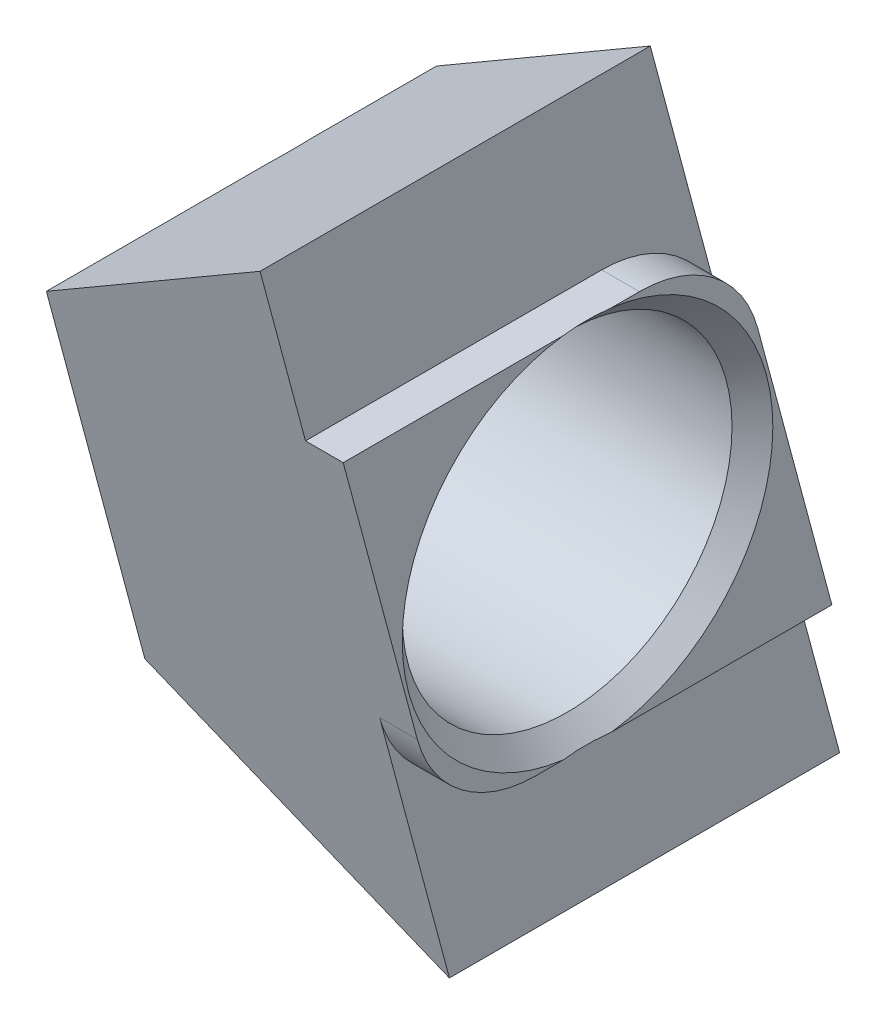
ISO-10303-21;
HEADER;
FILE_DESCRIPTION(('STEP AP214'),'2;1');
FILE_NAME('part.step','',(''),(''),'','','');
FILE_SCHEMA(('AUTOMOTIVE_DESIGN { 1 0 10303 214 1 1 1 1 }'));
ENDSEC;
DATA;
#1=APPLICATION_CONTEXT('core data for automotive mechanical design processes');
#2=APPLICATION_PROTOCOL_DEFINITION('international standard','automotive_design',2000,#1);
#3=PRODUCT_CONTEXT('',#1,'mechanical');
#4=PRODUCT('Part','Part','',(#3));
#5=PRODUCT_RELATED_PRODUCT_CATEGORY('part','',(#4));
#6=PRODUCT_DEFINITION_FORMATION('','',#4);
#7=PRODUCT_DEFINITION_CONTEXT('part definition',#1,'design');
#8=PRODUCT_DEFINITION('design','',#6,#7);
#9=PRODUCT_DEFINITION_SHAPE('','',#8);
#10=(LENGTH_UNIT() NAMED_UNIT(*) SI_UNIT(.MILLI.,.METRE.));
#11=(NAMED_UNIT(*) PLANE_ANGLE_UNIT() SI_UNIT($,.RADIAN.));
#12=(NAMED_UNIT(*) SI_UNIT($,.STERADIAN.) SOLID_ANGLE_UNIT());
#13=UNCERTAINTY_MEASURE_WITH_UNIT(LENGTH_MEASURE(1.E-05),#10,'distance_accuracy_value','');
#14=(GEOMETRIC_REPRESENTATION_CONTEXT(3) GLOBAL_UNCERTAINTY_ASSIGNED_CONTEXT((#13)) GLOBAL_UNIT_ASSIGNED_CONTEXT((#10,
#11,#12)) REPRESENTATION_CONTEXT('',''));
#15=CARTESIAN_POINT('',(0.,0.,0.));
#16=DIRECTION('',(0.,0.,1.));
#17=DIRECTION('',(1.,0.,0.));
#18=AXIS2_PLACEMENT_3D('',#15,#16,#17);
#19=CARTESIAN_POINT('',(-6.3,0.,4.14110472164033));
#20=DIRECTION('',(-1.,0.,0.));
#21=DIRECTION('',(0.,0.,1.));
#22=AXIS2_PLACEMENT_3D('',#19,#20,#21);
#23=PLANE('',#22);
#24=DIRECTION('',(0.,0.,1.));
#25=VECTOR('',#24,1.);
#26=CARTESIAN_POINT('',(-6.3,3.90000000000003,-2.13148577840691));
#27=LINE('',#26,#25);
#28=CARTESIAN_POINT('',(-6.3,3.90000000000003,5.18610657212172));
#29=VERTEX_POINT('',#28);
#30=CARTESIAN_POINT('',(-6.3,3.90000000000003,0.508418135000282));
#31=VERTEX_POINT('',#30);
#32=EDGE_CURVE('E178',#29,#31,#27,.F.);
#33=ORIENTED_EDGE('',*,*,#32,.T.);
#34=CARTESIAN_POINT('',(-6.3,0.,0.));
#35=DIRECTION('',(-1.,0.,0.));
#36=DIRECTION('',(0.,0.,1.));
#37=AXIS2_PLACEMENT_3D('',#34,#35,#36);
#38=CIRCLE('',#37,3.93299999999967);
#39=CARTESIAN_POINT('',(-6.3,-3.90000000000003,0.508418135000279));
#40=VERTEX_POINT('',#39);
#41=EDGE_CURVE('E248',#31,#40,#38,.F.);
#42=ORIENTED_EDGE('',*,*,#41,.T.);
#43=DIRECTION('',(0.,0.,-1.));
#44=VECTOR('',#43,1.);
#45=CARTESIAN_POINT('',(-6.3,-3.90000000000003,2.13148577840691));
#46=LINE('',#45,#44);
#47=CARTESIAN_POINT('',(-6.3,-3.90000000000003,3.09610287115894));
#48=VERTEX_POINT('',#47);
#49=EDGE_CURVE('E200',#40,#48,#46,.F.);
#50=ORIENTED_EDGE('',*,*,#49,.T.);
#51=CARTESIAN_POINT('',(-6.3,-7.5,2.13148577840691));
#52=CARTESIAN_POINT('',(-6.3,-2.5,3.47123174056252));
#53=CARTESIAN_POINT('',(-6.3,2.5,4.81097770271814));
#54=CARTESIAN_POINT('',(-6.3,7.5,6.15072366487375));
#55=B_SPLINE_CURVE_WITH_KNOTS('',3,(#51,#52,#53,#54),.UNSPECIFIED.,.F.,.F.,(4,4),(0.,1.),.UNSPECIFIED.);
#56=EDGE_CURVE('E343',#48,#29,#55,.T.);
#57=ORIENTED_EDGE('',*,*,#56,.T.);
#58=EDGE_LOOP('',(#33,#42,#50,#57));
#59=FACE_BOUND('',#58,.T.);
#60=ADVANCED_FACE('F47',(#59),#23,.T.);
#61=CARTESIAN_POINT('',(0.,1.29999999999999,-1.10105270241365));
#62=DIRECTION('',(1.,0.,0.));
#63=DIRECTION('',(0.,0.,-1.));
#64=AXIS2_PLACEMENT_3D('',#61,#62,#63);
#65=PLANE('',#64);
#66=DIRECTION('',(0.,0.,1.));
#67=VECTOR('',#66,1.);
#68=CARTESIAN_POINT('',(0.,3.9,-1.10105270241365));
#69=LINE('',#68,#67);
#70=CARTESIAN_POINT('',(0.,3.9,-1.10105270241365));
#71=VERTEX_POINT('',#70);
#72=CARTESIAN_POINT('',(0.,3.9,-0.508418135000436));
#73=VERTEX_POINT('',#72);
#74=EDGE_CURVE('E258',#71,#73,#69,.T.);
#75=ORIENTED_EDGE('',*,*,#74,.T.);
#76=CARTESIAN_POINT('',(0.,0.,0.));
#77=DIRECTION('',(1.,0.,0.));
#78=DIRECTION('',(0.,0.,-1.));
#79=AXIS2_PLACEMENT_3D('',#76,#77,#78);
#80=CIRCLE('',#79,3.93299999999966);
#81=CARTESIAN_POINT('',(0.,-3.9,-0.508418135000436));
#82=VERTEX_POINT('',#81);
#83=EDGE_CURVE('E212',#73,#82,#80,.F.);
#84=ORIENTED_EDGE('',*,*,#83,.T.);
#85=DIRECTION('',(0.,0.,-1.));
#86=VECTOR('',#85,1.);
#87=CARTESIAN_POINT('',(0.,-3.9,1.10105270241365));
#88=LINE('',#87,#86);
#89=CARTESIAN_POINT('',(0.,-3.9,-5.18610657212171));
#90=VERTEX_POINT('',#89);
#91=EDGE_CURVE('E276',#82,#90,#88,.T.);
#92=ORIENTED_EDGE('',*,*,#91,.T.);
#93=DIRECTION('',(0.,0.965925826289068,0.25881904510252));
#94=VECTOR('',#93,1.);
#95=CARTESIAN_POINT('',(0.,-3.9,-5.18610657212171));
#96=LINE('',#95,#94);
#97=CARTESIAN_POINT('',(0.,1.97292951726655,-3.61245985076524));
#98=VERTEX_POINT('',#97);
#99=EDGE_CURVE('E282',#90,#98,#96,.T.);
#100=ORIENTED_EDGE('',*,*,#99,.T.);
#101=CARTESIAN_POINT('',(0.,1.29999999999999,-1.10105270241365));
#102=DIRECTION('',(1.,0.,0.));
#103=DIRECTION('',(0.,0.,-1.));
#104=AXIS2_PLACEMENT_3D('',#101,#102,#103);
#105=CIRCLE('',#104,2.60000000000001);
#106=EDGE_CURVE('E180',#98,#71,#105,.T.);
#107=ORIENTED_EDGE('',*,*,#106,.T.);
#108=EDGE_LOOP('',(#75,#84,#92,#100,#107));
#109=FACE_BOUND('',#108,.T.);
#110=ADVANCED_FACE('F262',(#109),#65,.T.);
#111=CARTESIAN_POINT('',(-0.800000000000001,1.29999999999999,-1.10105270241365));
#112=DIRECTION('',(1.,0.,0.));
#113=DIRECTION('',(0.,0.,-1.));
#114=AXIS2_PLACEMENT_3D('',#111,#112,#113);
#115=CYLINDRICAL_SURFACE('',#114,2.60000000000001);
#116=ORIENTED_EDGE('',*,*,#106,.F.);
#117=DIRECTION('',(1.,0.,0.));
#118=VECTOR('',#117,1.);
#119=CARTESIAN_POINT('',(-0.800000000000001,1.97292951726655,-3.61245985076524));
#120=LINE('',#119,#118);
#121=CARTESIAN_POINT('',(-0.800000000000001,1.97292951726655,-3.61245985076523));
#122=VERTEX_POINT('',#121);
#123=EDGE_CURVE('E207',#122,#98,#120,.T.);
#124=ORIENTED_EDGE('',*,*,#123,.F.);
#125=CARTESIAN_POINT('',(-0.800000000000001,1.29999999999999,-1.10105270241365));
#126=DIRECTION('',(1.,0.,0.));
#127=DIRECTION('',(0.,0.,-1.));
#128=AXIS2_PLACEMENT_3D('',#125,#126,#127);
#129=CIRCLE('',#128,2.60000000000001);
#130=CARTESIAN_POINT('',(-0.800000000000001,3.9,-1.10105270241365));
#131=VERTEX_POINT('',#130);
#132=EDGE_CURVE('E284',#122,#131,#129,.T.);
#133=ORIENTED_EDGE('',*,*,#132,.T.);
#134=DIRECTION('',(1.,0.,0.));
#135=VECTOR('',#134,1.);
#136=CARTESIAN_POINT('',(-0.800000000000001,3.9,-1.10105270241365));
#137=LINE('',#136,#135);
#138=EDGE_CURVE('E293',#131,#71,#137,.T.);
#139=ORIENTED_EDGE('',*,*,#138,.T.);
#140=EDGE_LOOP('',(#116,#124,#133,#139));
#141=FACE_BOUND('',#140,.T.);
#142=ADVANCED_FACE('F332',(#141),#115,.T.);
#143=CARTESIAN_POINT('',(-0.800000000000001,-3.9,-5.18610657212171));
#144=DIRECTION('',(0.,0.25881904510252,-0.965925826289068));
#145=DIRECTION('',(0.,0.965925826289068,0.25881904510252));
#146=AXIS2_PLACEMENT_3D('',#143,#144,#145);
#147=PLANE('',#146);
#148=ORIENTED_EDGE('',*,*,#99,.F.);
#149=DIRECTION('',(1.,0.,0.));
#150=VECTOR('',#149,1.);
#151=CARTESIAN_POINT('',(-0.800000000000001,-3.9,-5.18610657212171));
#152=LINE('',#151,#150);
#153=CARTESIAN_POINT('',(-0.800000000000001,-3.9,-5.18610657212171));
#154=VERTEX_POINT('',#153);
#155=EDGE_CURVE('E291',#154,#90,#152,.T.);
#156=ORIENTED_EDGE('',*,*,#155,.F.);
#157=CARTESIAN_POINT('',(-0.800000000000001,7.5,-2.13148577840691));
#158=CARTESIAN_POINT('',(-0.800000000000001,2.5,-3.47123174056252));
#159=CARTESIAN_POINT('',(-0.800000000000001,-2.5,-4.81097770271814));
#160=CARTESIAN_POINT('',(-0.800000000000001,-7.5,-6.15072366487375));
#161=B_SPLINE_CURVE_WITH_KNOTS('',3,(#157,#158,#159,#160),.UNSPECIFIED.,.F.,.F.,(4,4),(0.,1.),.UNSPECIFIED.);
#162=CARTESIAN_POINT('',(-0.800000000000001,-7.5,-6.15072366487375));
#163=VERTEX_POINT('',#162);
#164=EDGE_CURVE('E173',#154,#163,#161,.T.);
#165=ORIENTED_EDGE('',*,*,#164,.T.);
#166=DIRECTION('',(-0.827835666345006,0.541856072516727,0.145189897044757));
#167=VECTOR('',#166,1.);
#168=CARTESIAN_POINT('',(-2.53078460239917,-6.36712280570237,-5.84717013553806));
#169=LINE('',#168,#167);
#170=CARTESIAN_POINT('',(-6.3,-3.90000000000003,-5.18610657212172));
#171=VERTEX_POINT('',#170);
#172=EDGE_CURVE('E186',#171,#163,#169,.F.);
#173=ORIENTED_EDGE('',*,*,#172,.F.);
#174=CARTESIAN_POINT('',(-6.3,7.5,-2.13148577840691));
#175=CARTESIAN_POINT('',(-6.3,2.5,-3.47123174056252));
#176=CARTESIAN_POINT('',(-6.3,-2.5,-4.81097770271814));
#177=CARTESIAN_POINT('',(-6.3,-7.5,-6.15072366487375));
#178=B_SPLINE_CURVE_WITH_KNOTS('',3,(#174,#175,#176,#177),.UNSPECIFIED.,.F.,.F.,(4,4),(0.,1.),.UNSPECIFIED.);
#179=CARTESIAN_POINT('',(-6.3,3.90000000000003,-3.09610287115894));
#180=VERTEX_POINT('',#179);
#181=EDGE_CURVE('E192',#180,#171,#178,.T.);
#182=ORIENTED_EDGE('',*,*,#181,.F.);
#183=DIRECTION('',(-0.827835666345006,-0.541856072516727,-0.145189897044757));
#184=VECTOR('',#183,1.);
#185=CARTESIAN_POINT('',(-0.8,7.5,-2.13148577840691));
#186=LINE('',#185,#184);
#187=CARTESIAN_POINT('',(-0.800000000000001,7.5,-2.13148577840691));
#188=VERTEX_POINT('',#187);
#189=EDGE_CURVE('E181',#180,#188,#186,.F.);
#190=ORIENTED_EDGE('',*,*,#189,.T.);
#191=EDGE_CURVE('E169',#188,#122,#161,.T.);
#192=ORIENTED_EDGE('',*,*,#191,.T.);
#193=ORIENTED_EDGE('',*,*,#123,.T.);
#194=EDGE_LOOP('',(#148,#156,#165,#173,#182,#190,#192,#193));
#195=FACE_BOUND('',#194,.T.);
#196=ADVANCED_FACE('F329',(#195),#147,.T.);
#197=CARTESIAN_POINT('',(-0.800000000000001,-3.9,1.10105270241365));
#198=DIRECTION('',(0.,-1.,0.));
#199=DIRECTION('',(0.,0.,-1.));
#200=AXIS2_PLACEMENT_3D('',#197,#198,#199);
#201=PLANE('',#200);
#202=ORIENTED_EDGE('',*,*,#91,.F.);
#203=CARTESIAN_POINT('',(0.,-3.9,-0.508418135000436));
#204=CARTESIAN_POINT('',(-0.0219999999997728,-3.9,-0.338945423333624));
#205=CARTESIAN_POINT('',(-0.0329999999996592,-3.9,-0.169472711666812));
#206=CARTESIAN_POINT('',(-0.032999999999659,-3.9,0.169472711666811));
#207=CARTESIAN_POINT('',(-0.0219999999997725,-3.9,0.338945423333623));
#208=CARTESIAN_POINT('',(0.,-3.9,0.508418135000435));
#209=B_SPLINE_CURVE_WITH_KNOTS('',3,(#203,#204,#205,#206,#207,#208),.UNSPECIFIED.,.F.,.F.,(4,2,
4),(0.,0.509487978265728,1.01897595653146),.UNSPECIFIED.);
#210=CARTESIAN_POINT('',(0.,-3.9,0.508418135000435));
#211=VERTEX_POINT('',#210);
#212=EDGE_CURVE('E215',#82,#211,#209,.T.);
#213=ORIENTED_EDGE('',*,*,#212,.T.);
#214=CARTESIAN_POINT('',(0.,-3.9,1.10105270241365));
#215=VERTEX_POINT('',#214);
#216=EDGE_CURVE('E273',#215,#211,#88,.T.);
#217=ORIENTED_EDGE('',*,*,#216,.F.);
#218=DIRECTION('',(1.,0.,0.));
#219=VECTOR('',#218,1.);
#220=CARTESIAN_POINT('',(-0.800000000000001,-3.9,1.10105270241365));
#221=LINE('',#220,#219);
#222=CARTESIAN_POINT('',(-0.800000000000001,-3.9,1.10105270241365));
#223=VERTEX_POINT('',#222);
#224=EDGE_CURVE('E289',#223,#215,#221,.T.);
#225=ORIENTED_EDGE('',*,*,#224,.F.);
#226=DIRECTION('',(0.,0.,-1.));
#227=VECTOR('',#226,1.);
#228=CARTESIAN_POINT('',(-0.800000000000001,-3.9,1.10105270241365));
#229=LINE('',#228,#227);
#230=EDGE_CURVE('E295',#223,#154,#229,.T.);
#231=ORIENTED_EDGE('',*,*,#230,.T.);
#232=ORIENTED_EDGE('',*,*,#155,.T.);
#233=EDGE_LOOP('',(#202,#213,#217,#225,#231,#232));
#234=FACE_BOUND('',#233,.T.);
#235=ADVANCED_FACE('F227',(#234),#201,.T.);
#236=CARTESIAN_POINT('',(-0.800000000000001,-1.3,1.10105270241365));
#237=DIRECTION('',(1.,0.,0.));
#238=DIRECTION('',(0.,0.,-1.));
#239=AXIS2_PLACEMENT_3D('',#236,#237,#238);
#240=CYLINDRICAL_SURFACE('',#239,2.6);
#241=CARTESIAN_POINT('',(0.,-1.3,1.10105270241365));
#242=DIRECTION('',(1.,0.,0.));
#243=DIRECTION('',(0.,0.,-1.));
#244=AXIS2_PLACEMENT_3D('',#241,#242,#243);
#245=CIRCLE('',#244,2.6);
#246=CARTESIAN_POINT('',(0.,-1.97292951726655,3.61245985076523));
#247=VERTEX_POINT('',#246);
#248=EDGE_CURVE('E281',#247,#215,#245,.T.);
#249=ORIENTED_EDGE('',*,*,#248,.F.);
#250=DIRECTION('',(1.,0.,0.));
#251=VECTOR('',#250,1.);
#252=CARTESIAN_POINT('',(-0.800000000000001,-1.97292951726655,3.61245985076523));
#253=LINE('',#252,#251);
#254=CARTESIAN_POINT('',(-0.800000000000001,-1.97292951726656,3.61245985076523));
#255=VERTEX_POINT('',#254);
#256=EDGE_CURVE('E292',#255,#247,#253,.T.);
#257=ORIENTED_EDGE('',*,*,#256,.F.);
#258=CARTESIAN_POINT('',(-0.800000000000001,-1.3,1.10105270241365));
#259=DIRECTION('',(1.,0.,0.));
#260=DIRECTION('',(0.,0.,-1.));
#261=AXIS2_PLACEMENT_3D('',#258,#259,#260);
#262=CIRCLE('',#261,2.6);
#263=EDGE_CURVE('E302',#255,#223,#262,.T.);
#264=ORIENTED_EDGE('',*,*,#263,.T.);
#265=ORIENTED_EDGE('',*,*,#224,.T.);
#266=EDGE_LOOP('',(#249,#257,#264,#265));
#267=FACE_BOUND('',#266,.T.);
#268=ADVANCED_FACE('F323',(#267),#240,.T.);
#269=CARTESIAN_POINT('',(-0.800000000000001,3.9,5.18610657212171));
#270=DIRECTION('',(0.,-0.258819045102521,0.965925826289068));
#271=DIRECTION('',(0.,-0.965925826289068,-0.258819045102521));
#272=AXIS2_PLACEMENT_3D('',#269,#270,#271);
#273=PLANE('',#272);
#274=DIRECTION('',(0.,-0.965925826289068,-0.258819045102521));
#275=VECTOR('',#274,1.);
#276=CARTESIAN_POINT('',(0.,3.9,5.18610657212171));
#277=LINE('',#276,#275);
#278=CARTESIAN_POINT('',(0.,3.9,5.18610657212171));
#279=VERTEX_POINT('',#278);
#280=EDGE_CURVE('E266',#279,#247,#277,.T.);
#281=ORIENTED_EDGE('',*,*,#280,.F.);
#282=DIRECTION('',(1.,0.,0.));
#283=VECTOR('',#282,1.);
#284=CARTESIAN_POINT('',(-0.800000000000001,3.9,5.18610657212171));
#285=LINE('',#284,#283);
#286=CARTESIAN_POINT('',(-0.800000000000001,3.9,5.18610657212171));
#287=VERTEX_POINT('',#286);
#288=EDGE_CURVE('E160',#287,#279,#285,.T.);
#289=ORIENTED_EDGE('',*,*,#288,.F.);
#290=CARTESIAN_POINT('',(-0.800000000000001,-7.5,2.13148577840691));
#291=CARTESIAN_POINT('',(-0.800000000000001,-2.5,3.47123174056252));
#292=CARTESIAN_POINT('',(-0.800000000000001,2.5,4.81097770271814));
#293=CARTESIAN_POINT('',(-0.800000000000001,7.5,6.15072366487375));
#294=B_SPLINE_CURVE_WITH_KNOTS('',3,(#290,#291,#292,#293),.UNSPECIFIED.,.F.,.F.,(4,4),(0.,1.),.UNSPECIFIED.);
#295=CARTESIAN_POINT('',(-0.800000000000001,7.5,6.15072366487375));
#296=VERTEX_POINT('',#295);
#297=EDGE_CURVE('E152',#287,#296,#294,.T.);
#298=ORIENTED_EDGE('',*,*,#297,.T.);
#299=DIRECTION('',(-0.827835666345006,-0.541856072516727,-0.145189897044757));
#300=VECTOR('',#299,1.);
#301=CARTESIAN_POINT('',(-2.53078460239917,6.36712280570237,5.84717013553807));
#302=LINE('',#301,#300);
#303=EDGE_CURVE('E158',#29,#296,#302,.F.);
#304=ORIENTED_EDGE('',*,*,#303,.F.);
#305=ORIENTED_EDGE('',*,*,#56,.F.);
#306=DIRECTION('',(-0.827835666345006,0.541856072516727,0.145189897044757));
#307=VECTOR('',#306,1.);
#308=CARTESIAN_POINT('',(-0.800000000000001,-7.5,2.1314857784069));
#309=LINE('',#308,#307);
#310=CARTESIAN_POINT('',(-0.800000000000001,-7.5,2.13148577840691));
#311=VERTEX_POINT('',#310);
#312=EDGE_CURVE('E197',#48,#311,#309,.F.);
#313=ORIENTED_EDGE('',*,*,#312,.T.);
#314=EDGE_CURVE('E163',#311,#255,#294,.T.);
#315=ORIENTED_EDGE('',*,*,#314,.T.);
#316=ORIENTED_EDGE('',*,*,#256,.T.);
#317=EDGE_LOOP('',(#281,#289,#298,#304,#305,#313,#315,#316));
#318=FACE_BOUND('',#317,.T.);
#319=ADVANCED_FACE('F155',(#318),#273,.T.);
#320=CARTESIAN_POINT('',(-0.800000000000001,3.9,-1.10105270241365));
#321=DIRECTION('',(0.,1.,0.));
#322=DIRECTION('',(0.,0.,1.));
#323=AXIS2_PLACEMENT_3D('',#320,#321,#322);
#324=PLANE('',#323);
#325=CARTESIAN_POINT('',(0.,3.9,0.508418135000435));
#326=VERTEX_POINT('',#325);
#327=EDGE_CURVE('E184',#326,#279,#69,.T.);
#328=ORIENTED_EDGE('',*,*,#327,.F.);
#329=CARTESIAN_POINT('',(0.,3.9,0.508418135000435));
#330=CARTESIAN_POINT('',(-0.0219999999997729,3.9,0.338945423333623));
#331=CARTESIAN_POINT('',(-0.0329999999996592,3.9,0.169472711666811));
#332=CARTESIAN_POINT('',(-0.0329999999996591,3.9,-0.169472711666812));
#333=CARTESIAN_POINT('',(-0.0219999999997725,3.9,-0.338945423333624));
#334=CARTESIAN_POINT('',(0.,3.9,-0.508418135000436));
#335=B_SPLINE_CURVE_WITH_KNOTS('',3,(#329,#330,#331,#332,#333,#334),.UNSPECIFIED.,.F.,.F.,(4,2,
4),(0.,0.509487978265728,1.01897595653146),.UNSPECIFIED.);
#336=EDGE_CURVE('E221',#326,#73,#335,.T.);
#337=ORIENTED_EDGE('',*,*,#336,.T.);
#338=ORIENTED_EDGE('',*,*,#74,.F.);
#339=ORIENTED_EDGE('',*,*,#138,.F.);
#340=DIRECTION('',(0.,0.,1.));
#341=VECTOR('',#340,1.);
#342=CARTESIAN_POINT('',(-0.800000000000001,3.9,-1.10105270241365));
#343=LINE('',#342,#341);
#344=EDGE_CURVE('E299',#131,#287,#343,.T.);
#345=ORIENTED_EDGE('',*,*,#344,.T.);
#346=ORIENTED_EDGE('',*,*,#288,.T.);
#347=EDGE_LOOP('',(#328,#337,#338,#339,#345,#346));
#348=FACE_BOUND('',#347,.T.);
#349=ADVANCED_FACE('F256',(#348),#324,.T.);
#350=ORIENTED_EDGE('',*,*,#216,.T.);
#351=CARTESIAN_POINT('',(0.,0.,0.));
#352=DIRECTION('',(1.,0.,0.));
#353=DIRECTION('',(0.,0.,-1.));
#354=AXIS2_PLACEMENT_3D('',#351,#352,#353);
#355=CIRCLE('',#354,3.93299999999966);
#356=EDGE_CURVE('E210',#211,#326,#355,.F.);
#357=ORIENTED_EDGE('',*,*,#356,.T.);
#358=ORIENTED_EDGE('',*,*,#327,.T.);
#359=ORIENTED_EDGE('',*,*,#280,.T.);
#360=ORIENTED_EDGE('',*,*,#248,.T.);
#361=EDGE_LOOP('',(#350,#357,#358,#359,#360));
#362=FACE_BOUND('',#361,.T.);
#363=ADVANCED_FACE('F278',(#362),#65,.T.);
#364=CARTESIAN_POINT('',(-0.800000000000001,0.,4.14110472164033));
#365=DIRECTION('',(-1.,0.,0.));
#366=DIRECTION('',(0.,0.,1.));
#367=AXIS2_PLACEMENT_3D('',#364,#365,#366);
#368=PLANE('',#367);
#369=ORIENTED_EDGE('',*,*,#230,.F.);
#370=ORIENTED_EDGE('',*,*,#263,.F.);
#371=ORIENTED_EDGE('',*,*,#314,.F.);
#372=DIRECTION('',(0.,0.,1.));
#373=VECTOR('',#372,1.);
#374=CARTESIAN_POINT('',(-0.800000000000001,-7.5,2.13148577840691));
#375=LINE('',#374,#373);
#376=EDGE_CURVE('E331',#163,#311,#375,.T.);
#377=ORIENTED_EDGE('',*,*,#376,.F.);
#378=ORIENTED_EDGE('',*,*,#164,.F.);
#379=EDGE_LOOP('',(#369,#370,#371,#377,#378));
#380=FACE_BOUND('',#379,.T.);
#381=ADVANCED_FACE('F342',(#380),#368,.F.);
#382=CARTESIAN_POINT('',(-0.800000000000001,7.5,-2.13148577840691));
#383=DIRECTION('',(-0.547659174694385,0.836701516894206,0.));
#384=DIRECTION('',(-0.836701516894206,-0.547659174694385,0.));
#385=AXIS2_PLACEMENT_3D('',#382,#383,#384);
#386=PLANE('',#385);
#387=CARTESIAN_POINT('',(-6.3,3.90000000000003,-0.508418135000284));
#388=VERTEX_POINT('',#387);
#389=EDGE_CURVE('E193',#388,#180,#27,.F.);
#390=ORIENTED_EDGE('',*,*,#389,.F.);
#391=CARTESIAN_POINT('',(-6.3,3.90000000000003,-0.508418135000289));
#392=CARTESIAN_POINT('',(-6.28670329670344,3.90870329670323,-0.338945423333526));
#393=CARTESIAN_POINT('',(-6.28005494505516,3.91305494505483,-0.169472711666764));
#394=CARTESIAN_POINT('',(-6.28005494505516,3.91305494505483,0.169472711666762));
#395=CARTESIAN_POINT('',(-6.28670329670344,3.90870329670323,0.338945423333525));
#396=CARTESIAN_POINT('',(-6.3,3.90000000000003,0.508418135000288));
#397=B_SPLINE_CURVE_WITH_KNOTS('',3,(#391,#392,#393,#394,#395,#396),.UNSPECIFIED.,.F.,.F.,(4,2,
4),(0.,0.508976656443405,1.01795331288681),.UNSPECIFIED.);
#398=EDGE_CURVE('E13',#388,#31,#397,.T.);
#399=ORIENTED_EDGE('',*,*,#398,.T.);
#400=ORIENTED_EDGE('',*,*,#32,.F.);
#401=ORIENTED_EDGE('',*,*,#303,.T.);
#402=DIRECTION('',(0.,0.,-1.));
#403=VECTOR('',#402,1.);
#404=CARTESIAN_POINT('',(-0.800000000000001,7.5,-2.13148577840691));
#405=LINE('',#404,#403);
#406=EDGE_CURVE('E166',#296,#188,#405,.T.);
#407=ORIENTED_EDGE('',*,*,#406,.T.);
#408=ORIENTED_EDGE('',*,*,#189,.F.);
#409=EDGE_LOOP('',(#390,#399,#400,#401,#407,#408));
#410=FACE_BOUND('',#409,.T.);
#411=ADVANCED_FACE('F176',(#410),#386,.T.);
#412=CARTESIAN_POINT('',(-0.800000000000001,-7.5,2.13148577840691));
#413=DIRECTION('',(-0.547659174694385,-0.836701516894206,0.));
#414=DIRECTION('',(0.836701516894206,-0.547659174694385,0.));
#415=AXIS2_PLACEMENT_3D('',#412,#413,#414);
#416=PLANE('',#415);
#417=ORIENTED_EDGE('',*,*,#49,.F.);
#418=CARTESIAN_POINT('',(-6.3,-3.90000000000003,0.508418135000285));
#419=CARTESIAN_POINT('',(-6.28670329670344,-3.90870329670323,0.338945423333523));
#420=CARTESIAN_POINT('',(-6.28005494505516,-3.91305494505483,0.169472711666762));
#421=CARTESIAN_POINT('',(-6.28005494505516,-3.91305494505483,-0.169472711666762));
#422=CARTESIAN_POINT('',(-6.28670329670344,-3.90870329670323,-0.338945423333524));
#423=CARTESIAN_POINT('',(-6.3,-3.90000000000003,-0.508418135000286));
#424=B_SPLINE_CURVE_WITH_KNOTS('',3,(#418,#419,#420,#421,#422,#423),.UNSPECIFIED.,.F.,.F.,(4,2,
4),(0.,0.508976656443402,1.0179533128868),.UNSPECIFIED.);
#425=CARTESIAN_POINT('',(-6.3,-3.90000000000003,-0.508418135000286));
#426=VERTEX_POINT('',#425);
#427=EDGE_CURVE('E60',#40,#426,#424,.T.);
#428=ORIENTED_EDGE('',*,*,#427,.T.);
#429=EDGE_CURVE('E198',#171,#426,#46,.F.);
#430=ORIENTED_EDGE('',*,*,#429,.F.);
#431=ORIENTED_EDGE('',*,*,#172,.T.);
#432=ORIENTED_EDGE('',*,*,#376,.T.);
#433=ORIENTED_EDGE('',*,*,#312,.F.);
#434=EDGE_LOOP('',(#417,#428,#430,#431,#432,#433));
#435=FACE_BOUND('',#434,.T.);
#436=ADVANCED_FACE('F237',(#435),#416,.T.);
#437=ORIENTED_EDGE('',*,*,#429,.T.);
#438=CARTESIAN_POINT('',(-6.3,0.,0.));
#439=DIRECTION('',(-1.,0.,0.));
#440=DIRECTION('',(0.,0.,1.));
#441=AXIS2_PLACEMENT_3D('',#438,#439,#440);
#442=CIRCLE('',#441,3.93299999999967);
#443=EDGE_CURVE('E249',#426,#388,#442,.F.);
#444=ORIENTED_EDGE('',*,*,#443,.T.);
#445=ORIENTED_EDGE('',*,*,#389,.T.);
#446=ORIENTED_EDGE('',*,*,#181,.T.);
#447=EDGE_LOOP('',(#437,#444,#445,#446));
#448=FACE_BOUND('',#447,.T.);
#449=ADVANCED_FACE('F241',(#448),#23,.T.);
#450=ORIENTED_EDGE('',*,*,#132,.F.);
#451=ORIENTED_EDGE('',*,*,#191,.F.);
#452=ORIENTED_EDGE('',*,*,#406,.F.);
#453=ORIENTED_EDGE('',*,*,#297,.F.);
#454=ORIENTED_EDGE('',*,*,#344,.F.);
#455=EDGE_LOOP('',(#450,#451,#452,#453,#454));
#456=FACE_BOUND('',#455,.T.);
#457=ADVANCED_FACE('F167',(#456),#368,.F.);
#458=CARTESIAN_POINT('',(-6.3,0.,0.));
#459=DIRECTION('',(-1.,0.,0.));
#460=DIRECTION('',(0.,0.,1.));
#461=AXIS2_PLACEMENT_3D('',#458,#459,#460);
#462=CYLINDRICAL_SURFACE('',#461,3.5);
#463=CARTESIAN_POINT('',(-0.432999999999658,0.,0.));
#464=DIRECTION('',(1.,0.,0.));
#465=DIRECTION('',(0.,0.,-1.));
#466=AXIS2_PLACEMENT_3D('',#463,#464,#465);
#467=CIRCLE('',#466,3.5);
#468=CARTESIAN_POINT('',(-0.432999999999659,0.,-3.5));
#469=VERTEX_POINT('',#468);
#470=EDGE_CURVE('E206',#469,#469,#467,.T.);
#471=ORIENTED_EDGE('',*,*,#470,.T.);
#472=EDGE_LOOP('',(#471));
#473=FACE_BOUND('',#472,.T.);
#474=CARTESIAN_POINT('',(-5.86700000000033,0.,0.));
#475=DIRECTION('',(-1.,0.,0.));
#476=DIRECTION('',(0.,0.,1.));
#477=AXIS2_PLACEMENT_3D('',#474,#475,#476);
#478=CIRCLE('',#477,3.5);
#479=CARTESIAN_POINT('',(-5.86700000000033,0.,3.5));
#480=VERTEX_POINT('',#479);
#481=EDGE_CURVE('E203',#480,#480,#478,.T.);
#482=ORIENTED_EDGE('',*,*,#481,.T.);
#483=EDGE_LOOP('',(#482));
#484=FACE_BOUND('',#483,.T.);
#485=ADVANCED_FACE('F235',(#473,#484),#462,.F.);
#486=CARTESIAN_POINT('',(-0.432999999999658,0.,0.));
#487=DIRECTION('',(1.,0.,0.));
#488=DIRECTION('',(0.,0.,-1.));
#489=AXIS2_PLACEMENT_3D('',#486,#487,#488);
#490=CONICAL_SURFACE('',#489,3.5,0.78539816339745);
#491=ORIENTED_EDGE('',*,*,#212,.F.);
#492=ORIENTED_EDGE('',*,*,#83,.F.);
#493=ORIENTED_EDGE('',*,*,#336,.F.);
#494=ORIENTED_EDGE('',*,*,#356,.F.);
#495=EDGE_LOOP('',(#491,#492,#493,#494));
#496=FACE_BOUND('',#495,.T.);
#497=ORIENTED_EDGE('',*,*,#470,.F.);
#498=EDGE_LOOP('',(#497));
#499=FACE_BOUND('',#498,.T.);
#500=ADVANCED_FACE('F231',(#496,#499),#490,.F.);
#501=CARTESIAN_POINT('',(-5.86700000000033,0.,0.));
#502=DIRECTION('',(-1.,0.,0.));
#503=DIRECTION('',(0.,0.,1.));
#504=AXIS2_PLACEMENT_3D('',#501,#502,#503);
#505=CONICAL_SURFACE('',#504,3.5,0.785398163397453);
#506=ORIENTED_EDGE('',*,*,#427,.F.);
#507=ORIENTED_EDGE('',*,*,#41,.F.);
#508=ORIENTED_EDGE('',*,*,#398,.F.);
#509=ORIENTED_EDGE('',*,*,#443,.F.);
#510=EDGE_LOOP('',(#506,#507,#508,#509));
#511=FACE_BOUND('',#510,.T.);
#512=ORIENTED_EDGE('',*,*,#481,.F.);
#513=EDGE_LOOP('',(#512));
#514=FACE_BOUND('',#513,.T.);
#515=ADVANCED_FACE('F49',(#511,#514),#505,.F.);
#516=CLOSED_SHELL('',(#60,#110,#142,#196,#235,#268,#319,#349,#363,#381,#411,#436,#449,#457,#485,
#500,#515));
#517=MANIFOLD_SOLID_BREP('B2',#516);
#518=ADVANCED_BREP_SHAPE_REPRESENTATION('',(#18,#517),#14);
#519=SHAPE_DEFINITION_REPRESENTATION(#9,#518);
ENDSEC;
END-ISO-10303-21;
